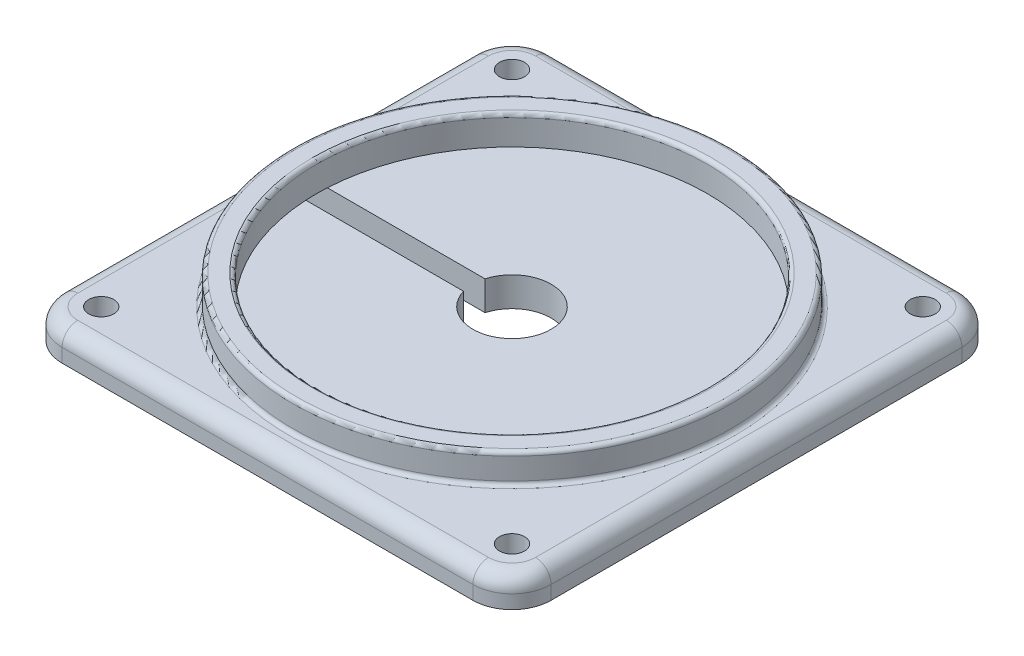
ISO-10303-21;
HEADER;
FILE_DESCRIPTION(('STEP AP214'),'2;1');
FILE_NAME('part.step','',(''),(''),'','','');
FILE_SCHEMA(('AUTOMOTIVE_DESIGN { 1 0 10303 214 1 1 1 1 }'));
ENDSEC;
DATA;
#1=APPLICATION_CONTEXT('core data for automotive mechanical design processes');
#2=APPLICATION_PROTOCOL_DEFINITION('international standard','automotive_design',2000,#1);
#3=PRODUCT_CONTEXT('',#1,'mechanical');
#4=PRODUCT('Part','Part','',(#3));
#5=PRODUCT_RELATED_PRODUCT_CATEGORY('part','',(#4));
#6=PRODUCT_DEFINITION_FORMATION('','',#4);
#7=PRODUCT_DEFINITION_CONTEXT('part definition',#1,'design');
#8=PRODUCT_DEFINITION('design','',#6,#7);
#9=PRODUCT_DEFINITION_SHAPE('','',#8);
#10=(LENGTH_UNIT() NAMED_UNIT(*) SI_UNIT(.MILLI.,.METRE.));
#11=(NAMED_UNIT(*) PLANE_ANGLE_UNIT() SI_UNIT($,.RADIAN.));
#12=(NAMED_UNIT(*) SI_UNIT($,.STERADIAN.) SOLID_ANGLE_UNIT());
#13=UNCERTAINTY_MEASURE_WITH_UNIT(LENGTH_MEASURE(1.E-05),#10,'distance_accuracy_value','');
#14=(GEOMETRIC_REPRESENTATION_CONTEXT(3) GLOBAL_UNCERTAINTY_ASSIGNED_CONTEXT((#13)) GLOBAL_UNIT_ASSIGNED_CONTEXT((#10,
#11,#12)) REPRESENTATION_CONTEXT('',''));
#15=CARTESIAN_POINT('',(0.,0.,0.));
#16=DIRECTION('',(0.,0.,1.));
#17=DIRECTION('',(1.,0.,0.));
#18=AXIS2_PLACEMENT_3D('',#15,#16,#17);
#19=CARTESIAN_POINT('',(0.,7.5,0.));
#20=DIRECTION('',(0.,-1.,0.));
#21=DIRECTION('',(0.,0.,-1.));
#22=AXIS2_PLACEMENT_3D('',#19,#20,#21);
#23=PLANE('',#22);
#24=CARTESIAN_POINT('',(-52.5,7.5,52.5));
#25=DIRECTION('',(0.,-1.,0.));
#26=DIRECTION('',(0.,0.,-1.));
#27=AXIS2_PLACEMENT_3D('',#24,#25,#26);
#28=CIRCLE('',#27,3.2);
#29=CARTESIAN_POINT('',(-52.5,7.5,49.3));
#30=VERTEX_POINT('',#29);
#31=EDGE_CURVE('E546',#30,#30,#28,.F.);
#32=ORIENTED_EDGE('',*,*,#31,.F.);
#33=EDGE_LOOP('',(#32));
#34=FACE_BOUND('',#33,.T.);
#35=CARTESIAN_POINT('',(52.5,7.5,-52.5));
#36=DIRECTION('',(0.,-1.,0.));
#37=DIRECTION('',(0.,0.,-1.));
#38=AXIS2_PLACEMENT_3D('',#35,#36,#37);
#39=CIRCLE('',#38,3.20000000000001);
#40=CARTESIAN_POINT('',(52.5,7.5,-55.7));
#41=VERTEX_POINT('',#40);
#42=EDGE_CURVE('E236',#41,#41,#39,.F.);
#43=ORIENTED_EDGE('',*,*,#42,.F.);
#44=EDGE_LOOP('',(#43));
#45=FACE_BOUND('',#44,.T.);
#46=CARTESIAN_POINT('',(52.5,7.5,52.5));
#47=DIRECTION('',(0.,-1.,0.));
#48=DIRECTION('',(0.,0.,-1.));
#49=AXIS2_PLACEMENT_3D('',#46,#47,#48);
#50=CIRCLE('',#49,3.20000000000001);
#51=CARTESIAN_POINT('',(52.5,7.5,49.3));
#52=VERTEX_POINT('',#51);
#53=EDGE_CURVE('E239',#52,#52,#50,.F.);
#54=ORIENTED_EDGE('',*,*,#53,.F.);
#55=EDGE_LOOP('',(#54));
#56=FACE_BOUND('',#55,.T.);
#57=CARTESIAN_POINT('',(-52.5,7.5,-52.5));
#58=DIRECTION('',(0.,-1.,0.));
#59=DIRECTION('',(0.,0.,-1.));
#60=AXIS2_PLACEMENT_3D('',#57,#58,#59);
#61=CIRCLE('',#60,3.2);
#62=CARTESIAN_POINT('',(-52.5,7.5,-55.7));
#63=VERTEX_POINT('',#62);
#64=EDGE_CURVE('E549',#63,#63,#61,.F.);
#65=ORIENTED_EDGE('',*,*,#64,.F.);
#66=EDGE_LOOP('',(#65));
#67=FACE_BOUND('',#66,.T.);
#68=DIRECTION('',(-1.,0.,0.));
#69=VECTOR('',#68,1.);
#70=CARTESIAN_POINT('',(62.501,7.5,-2.72545669135088));
#71=LINE('',#70,#69);
#72=CARTESIAN_POINT('',(-56.9348038182584,7.5,-2.72545669135088));
#73=VERTEX_POINT('',#72);
#74=CARTESIAN_POINT('',(-58.5,7.5,-2.72545669135088));
#75=VERTEX_POINT('',#74);
#76=EDGE_CURVE('E505',#73,#75,#71,.T.);
#77=ORIENTED_EDGE('',*,*,#76,.F.);
#78=CARTESIAN_POINT('',(0.,7.5,0.));
#79=DIRECTION('',(0.,-1.,0.));
#80=DIRECTION('',(0.,0.,-1.));
#81=AXIS2_PLACEMENT_3D('',#78,#79,#80);
#82=CIRCLE('',#81,57.);
#83=CARTESIAN_POINT('',(-56.9324328430503,7.5,2.77454330864912));
#84=VERTEX_POINT('',#83);
#85=EDGE_CURVE('E63',#73,#84,#82,.T.);
#86=ORIENTED_EDGE('',*,*,#85,.T.);
#87=DIRECTION('',(-1.,0.,0.));
#88=VECTOR('',#87,1.);
#89=CARTESIAN_POINT('',(62.501,7.5,2.77454330864912));
#90=LINE('',#89,#88);
#91=CARTESIAN_POINT('',(-58.5,7.5,2.77454330864912));
#92=VERTEX_POINT('',#91);
#93=EDGE_CURVE('E330',#84,#92,#90,.T.);
#94=ORIENTED_EDGE('',*,*,#93,.T.);
#95=DIRECTION('',(0.,0.,1.));
#96=VECTOR('',#95,1.);
#97=CARTESIAN_POINT('',(-58.5,7.5,0.));
#98=LINE('',#97,#96);
#99=CARTESIAN_POINT('',(-58.5,7.5,52.5));
#100=VERTEX_POINT('',#99);
#101=EDGE_CURVE('E252',#92,#100,#98,.T.);
#102=ORIENTED_EDGE('',*,*,#101,.T.);
#103=CARTESIAN_POINT('',(-52.5,7.5,52.5));
#104=DIRECTION('',(0.,-1.,0.));
#105=DIRECTION('',(0.,0.,-1.));
#106=AXIS2_PLACEMENT_3D('',#103,#104,#105);
#107=CIRCLE('',#106,6.);
#108=CARTESIAN_POINT('',(-52.5,7.5,58.5));
#109=VERTEX_POINT('',#108);
#110=EDGE_CURVE('E277',#109,#100,#107,.T.);
#111=ORIENTED_EDGE('',*,*,#110,.F.);
#112=DIRECTION('',(1.,0.,0.));
#113=VECTOR('',#112,1.);
#114=CARTESIAN_POINT('',(0.,7.5,58.5));
#115=LINE('',#114,#113);
#116=CARTESIAN_POINT('',(52.5,7.5,58.5));
#117=VERTEX_POINT('',#116);
#118=EDGE_CURVE('E249',#109,#117,#115,.T.);
#119=ORIENTED_EDGE('',*,*,#118,.T.);
#120=CARTESIAN_POINT('',(52.5,7.5,52.5));
#121=DIRECTION('',(0.,-1.,0.));
#122=DIRECTION('',(0.,0.,-1.));
#123=AXIS2_PLACEMENT_3D('',#120,#121,#122);
#124=CIRCLE('',#123,6.);
#125=CARTESIAN_POINT('',(58.5,7.5,52.5));
#126=VERTEX_POINT('',#125);
#127=EDGE_CURVE('E283',#126,#117,#124,.T.);
#128=ORIENTED_EDGE('',*,*,#127,.F.);
#129=DIRECTION('',(0.,0.,-1.));
#130=VECTOR('',#129,1.);
#131=CARTESIAN_POINT('',(58.5,7.5,0.));
#132=LINE('',#131,#130);
#133=CARTESIAN_POINT('',(58.5,7.5,-52.5));
#134=VERTEX_POINT('',#133);
#135=EDGE_CURVE('E246',#126,#134,#132,.T.);
#136=ORIENTED_EDGE('',*,*,#135,.T.);
#137=CARTESIAN_POINT('',(52.5,7.5,-52.5));
#138=DIRECTION('',(0.,-1.,0.));
#139=DIRECTION('',(0.,0.,-1.));
#140=AXIS2_PLACEMENT_3D('',#137,#138,#139);
#141=CIRCLE('',#140,6.);
#142=CARTESIAN_POINT('',(52.5,7.5,-58.5));
#143=VERTEX_POINT('',#142);
#144=EDGE_CURVE('E280',#143,#134,#141,.T.);
#145=ORIENTED_EDGE('',*,*,#144,.F.);
#146=DIRECTION('',(-1.,0.,0.));
#147=VECTOR('',#146,1.);
#148=CARTESIAN_POINT('',(0.,7.5,-58.5));
#149=LINE('',#148,#147);
#150=CARTESIAN_POINT('',(-52.5,7.5,-58.5));
#151=VERTEX_POINT('',#150);
#152=EDGE_CURVE('E243',#143,#151,#149,.T.);
#153=ORIENTED_EDGE('',*,*,#152,.T.);
#154=CARTESIAN_POINT('',(-52.5,7.5,-52.5));
#155=DIRECTION('',(0.,-1.,0.));
#156=DIRECTION('',(0.,0.,-1.));
#157=AXIS2_PLACEMENT_3D('',#154,#155,#156);
#158=CIRCLE('',#157,6.);
#159=CARTESIAN_POINT('',(-58.5,7.5,-52.5));
#160=VERTEX_POINT('',#159);
#161=EDGE_CURVE('E274',#160,#151,#158,.T.);
#162=ORIENTED_EDGE('',*,*,#161,.F.);
#163=DIRECTION('',(0.,0.,1.));
#164=VECTOR('',#163,1.);
#165=CARTESIAN_POINT('',(-58.5,7.5,0.));
#166=LINE('',#165,#164);
#167=EDGE_CURVE('E235',#160,#75,#166,.T.);
#168=ORIENTED_EDGE('',*,*,#167,.T.);
#169=EDGE_LOOP('',(#77,#86,#94,#102,#111,#119,#128,#136,#145,#153,#162,#168));
#170=FACE_BOUND('',#169,.T.);
#171=ADVANCED_FACE('F35',(#34,#45,#56,#67,#170),#23,.F.);
#172=CARTESIAN_POINT('',(-62.5,15.,62.5));
#173=DIRECTION('',(1.,0.,0.));
#174=DIRECTION('',(0.,0.,-1.));
#175=AXIS2_PLACEMENT_3D('',#172,#173,#174);
#176=PLANE('',#175);
#177=DIRECTION('',(0.,0.,1.));
#178=VECTOR('',#177,1.);
#179=CARTESIAN_POINT('',(-62.5,0.,62.5));
#180=LINE('',#179,#178);
#181=CARTESIAN_POINT('',(-62.5,0.,2.77454330864912));
#182=VERTEX_POINT('',#181);
#183=CARTESIAN_POINT('',(-62.5,0.,52.5));
#184=VERTEX_POINT('',#183);
#185=EDGE_CURVE('E207',#182,#184,#180,.T.);
#186=ORIENTED_EDGE('',*,*,#185,.T.);
#187=DIRECTION('',(0.,-1.,0.));
#188=VECTOR('',#187,1.);
#189=CARTESIAN_POINT('',(-62.5,15.,52.5));
#190=LINE('',#189,#188);
#191=CARTESIAN_POINT('',(-62.5,3.5,52.5));
#192=VERTEX_POINT('',#191);
#193=EDGE_CURVE('E320',#184,#192,#190,.F.);
#194=ORIENTED_EDGE('',*,*,#193,.T.);
#195=DIRECTION('',(0.,0.,1.));
#196=VECTOR('',#195,1.);
#197=CARTESIAN_POINT('',(-62.5,3.5,62.5));
#198=LINE('',#197,#196);
#199=CARTESIAN_POINT('',(-62.5,3.5,2.77454330864912));
#200=VERTEX_POINT('',#199);
#201=EDGE_CURVE('E255',#192,#200,#198,.F.);
#202=ORIENTED_EDGE('',*,*,#201,.T.);
#203=DIRECTION('',(0.,1.,0.));
#204=VECTOR('',#203,1.);
#205=CARTESIAN_POINT('',(-62.5,0.,2.77454330864912));
#206=LINE('',#205,#204);
#207=EDGE_CURVE('E208',#182,#200,#206,.T.);
#208=ORIENTED_EDGE('',*,*,#207,.F.);
#209=EDGE_LOOP('',(#186,#194,#202,#208));
#210=FACE_BOUND('',#209,.T.);
#211=ADVANCED_FACE('F379',(#210),#176,.F.);
#212=CARTESIAN_POINT('',(0.,15.,0.));
#213=DIRECTION('',(0.,-1.,0.));
#214=DIRECTION('',(0.,0.,-1.));
#215=AXIS2_PLACEMENT_3D('',#212,#213,#214);
#216=PLANE('',#215);
#217=CARTESIAN_POINT('',(0.,15.,0.));
#218=DIRECTION('',(0.,-1.,0.));
#219=DIRECTION('',(0.,0.,-1.));
#220=AXIS2_PLACEMENT_3D('',#217,#218,#219);
#221=CIRCLE('',#220,55.);
#222=CARTESIAN_POINT('',(0.,15.,-55.));
#223=VERTEX_POINT('',#222);
#224=EDGE_CURVE('E342',#223,#223,#221,.F.);
#225=ORIENTED_EDGE('',*,*,#224,.T.);
#226=EDGE_LOOP('',(#225));
#227=FACE_BOUND('',#226,.T.);
#228=CARTESIAN_POINT('',(0.,15.,0.));
#229=DIRECTION('',(0.,-1.,0.));
#230=DIRECTION('',(0.,0.,-1.));
#231=AXIS2_PLACEMENT_3D('',#228,#229,#230);
#232=CIRCLE('',#231,51.);
#233=CARTESIAN_POINT('',(0.,15.,-51.));
#234=VERTEX_POINT('',#233);
#235=EDGE_CURVE('E326',#234,#234,#232,.T.);
#236=ORIENTED_EDGE('',*,*,#235,.T.);
#237=EDGE_LOOP('',(#236));
#238=FACE_BOUND('',#237,.T.);
#239=ADVANCED_FACE('F406',(#227,#238),#216,.F.);
#240=CARTESIAN_POINT('',(62.5,15.,62.5));
#241=DIRECTION('',(-1.,0.,0.));
#242=DIRECTION('',(0.,0.,1.));
#243=AXIS2_PLACEMENT_3D('',#240,#241,#242);
#244=PLANE('',#243);
#245=DIRECTION('',(0.,0.,-1.));
#246=VECTOR('',#245,1.);
#247=CARTESIAN_POINT('',(62.5,0.,62.5));
#248=LINE('',#247,#246);
#249=CARTESIAN_POINT('',(62.5,0.,52.5));
#250=VERTEX_POINT('',#249);
#251=CARTESIAN_POINT('',(62.5,0.,-52.5));
#252=VERTEX_POINT('',#251);
#253=EDGE_CURVE('E224',#250,#252,#248,.T.);
#254=ORIENTED_EDGE('',*,*,#253,.T.);
#255=DIRECTION('',(0.,-1.,0.));
#256=VECTOR('',#255,1.);
#257=CARTESIAN_POINT('',(62.5,15.,-52.5));
#258=LINE('',#257,#256);
#259=CARTESIAN_POINT('',(62.5,3.5,-52.5));
#260=VERTEX_POINT('',#259);
#261=EDGE_CURVE('E324',#252,#260,#258,.F.);
#262=ORIENTED_EDGE('',*,*,#261,.T.);
#263=DIRECTION('',(0.,0.,-1.));
#264=VECTOR('',#263,1.);
#265=CARTESIAN_POINT('',(62.5,3.5,62.5));
#266=LINE('',#265,#264);
#267=CARTESIAN_POINT('',(62.5,3.5,52.5));
#268=VERTEX_POINT('',#267);
#269=EDGE_CURVE('E263',#260,#268,#266,.F.);
#270=ORIENTED_EDGE('',*,*,#269,.T.);
#271=DIRECTION('',(0.,-1.,0.));
#272=VECTOR('',#271,1.);
#273=CARTESIAN_POINT('',(62.5,15.,52.5));
#274=LINE('',#273,#272);
#275=EDGE_CURVE('E322',#268,#250,#274,.T.);
#276=ORIENTED_EDGE('',*,*,#275,.T.);
#277=EDGE_LOOP('',(#254,#262,#270,#276));
#278=FACE_BOUND('',#277,.T.);
#279=ADVANCED_FACE('F409',(#278),#244,.F.);
#280=CARTESIAN_POINT('',(-62.5,15.,-62.5));
#281=DIRECTION('',(0.,0.,1.));
#282=DIRECTION('',(1.,0.,0.));
#283=AXIS2_PLACEMENT_3D('',#280,#281,#282);
#284=PLANE('',#283);
#285=DIRECTION('',(-1.,0.,0.));
#286=VECTOR('',#285,1.);
#287=CARTESIAN_POINT('',(-62.5,0.,-62.5));
#288=LINE('',#287,#286);
#289=CARTESIAN_POINT('',(52.5,0.,-62.5));
#290=VERTEX_POINT('',#289);
#291=CARTESIAN_POINT('',(-52.5,0.,-62.5));
#292=VERTEX_POINT('',#291);
#293=EDGE_CURVE('E227',#290,#292,#288,.T.);
#294=ORIENTED_EDGE('',*,*,#293,.T.);
#295=DIRECTION('',(0.,-1.,0.));
#296=VECTOR('',#295,1.);
#297=CARTESIAN_POINT('',(-52.5,15.,-62.5));
#298=LINE('',#297,#296);
#299=CARTESIAN_POINT('',(-52.5,3.5,-62.5));
#300=VERTEX_POINT('',#299);
#301=EDGE_CURVE('E314',#292,#300,#298,.F.);
#302=ORIENTED_EDGE('',*,*,#301,.T.);
#303=DIRECTION('',(-1.,0.,0.));
#304=VECTOR('',#303,1.);
#305=CARTESIAN_POINT('',(-62.5,3.5,-62.5));
#306=LINE('',#305,#304);
#307=CARTESIAN_POINT('',(52.5,3.5,-62.5));
#308=VERTEX_POINT('',#307);
#309=EDGE_CURVE('E266',#300,#308,#306,.F.);
#310=ORIENTED_EDGE('',*,*,#309,.T.);
#311=DIRECTION('',(0.,-1.,0.));
#312=VECTOR('',#311,1.);
#313=CARTESIAN_POINT('',(52.5,15.,-62.5));
#314=LINE('',#313,#312);
#315=EDGE_CURVE('E312',#308,#290,#314,.T.);
#316=ORIENTED_EDGE('',*,*,#315,.T.);
#317=EDGE_LOOP('',(#294,#302,#310,#316));
#318=FACE_BOUND('',#317,.T.);
#319=ADVANCED_FACE('F420',(#318),#284,.F.);
#320=DIRECTION('',(0.,0.,1.));
#321=VECTOR('',#320,1.);
#322=CARTESIAN_POINT('',(-62.5,3.5,62.5));
#323=LINE('',#322,#321);
#324=CARTESIAN_POINT('',(-62.5,3.5,-2.72545669135088));
#325=VERTEX_POINT('',#324);
#326=CARTESIAN_POINT('',(-62.5,3.5,-52.5));
#327=VERTEX_POINT('',#326);
#328=EDGE_CURVE('E271',#325,#327,#323,.F.);
#329=ORIENTED_EDGE('',*,*,#328,.T.);
#330=DIRECTION('',(0.,-1.,0.));
#331=VECTOR('',#330,1.);
#332=CARTESIAN_POINT('',(-62.5,15.,-52.5));
#333=LINE('',#332,#331);
#334=CARTESIAN_POINT('',(-62.5,0.,-52.5));
#335=VERTEX_POINT('',#334);
#336=EDGE_CURVE('E302',#327,#335,#333,.T.);
#337=ORIENTED_EDGE('',*,*,#336,.T.);
#338=CARTESIAN_POINT('',(-62.5,0.,-2.72545669135088));
#339=VERTEX_POINT('',#338);
#340=EDGE_CURVE('E230',#335,#339,#180,.T.);
#341=ORIENTED_EDGE('',*,*,#340,.T.);
#342=DIRECTION('',(0.,-1.,0.));
#343=VECTOR('',#342,1.);
#344=CARTESIAN_POINT('',(-62.5,0.,-2.72545669135088));
#345=LINE('',#344,#343);
#346=EDGE_CURVE('E196',#325,#339,#345,.T.);
#347=ORIENTED_EDGE('',*,*,#346,.F.);
#348=EDGE_LOOP('',(#329,#337,#341,#347));
#349=FACE_BOUND('',#348,.T.);
#350=ADVANCED_FACE('F416',(#349),#176,.F.);
#351=CARTESIAN_POINT('',(-62.5,15.,62.5));
#352=DIRECTION('',(0.,0.,-1.));
#353=DIRECTION('',(-1.,0.,0.));
#354=AXIS2_PLACEMENT_3D('',#351,#352,#353);
#355=PLANE('',#354);
#356=DIRECTION('',(1.,0.,0.));
#357=VECTOR('',#356,1.);
#358=CARTESIAN_POINT('',(-62.5,3.5,62.5));
#359=LINE('',#358,#357);
#360=CARTESIAN_POINT('',(52.5,3.5,62.5));
#361=VERTEX_POINT('',#360);
#362=CARTESIAN_POINT('',(-52.5,3.5,62.5));
#363=VERTEX_POINT('',#362);
#364=EDGE_CURVE('E260',#361,#363,#359,.F.);
#365=ORIENTED_EDGE('',*,*,#364,.T.);
#366=DIRECTION('',(0.,-1.,0.));
#367=VECTOR('',#366,1.);
#368=CARTESIAN_POINT('',(-52.5,15.,62.5));
#369=LINE('',#368,#367);
#370=CARTESIAN_POINT('',(-52.5,0.,62.5));
#371=VERTEX_POINT('',#370);
#372=EDGE_CURVE('E318',#363,#371,#369,.T.);
#373=ORIENTED_EDGE('',*,*,#372,.T.);
#374=DIRECTION('',(1.,0.,0.));
#375=VECTOR('',#374,1.);
#376=CARTESIAN_POINT('',(-62.5,0.,62.5));
#377=LINE('',#376,#375);
#378=CARTESIAN_POINT('',(52.5,0.,62.5));
#379=VERTEX_POINT('',#378);
#380=EDGE_CURVE('E232',#371,#379,#377,.T.);
#381=ORIENTED_EDGE('',*,*,#380,.T.);
#382=DIRECTION('',(0.,-1.,0.));
#383=VECTOR('',#382,1.);
#384=CARTESIAN_POINT('',(52.5,15.,62.5));
#385=LINE('',#384,#383);
#386=EDGE_CURVE('E316',#379,#361,#385,.F.);
#387=ORIENTED_EDGE('',*,*,#386,.T.);
#388=EDGE_LOOP('',(#365,#373,#381,#387));
#389=FACE_BOUND('',#388,.T.);
#390=ADVANCED_FACE('F413',(#389),#355,.F.);
#391=CARTESIAN_POINT('',(0.,0.,0.));
#392=DIRECTION('',(0.,-1.,0.));
#393=DIRECTION('',(0.,0.,-1.));
#394=AXIS2_PLACEMENT_3D('',#391,#392,#393);
#395=PLANE('',#394);
#396=ORIENTED_EDGE('',*,*,#340,.F.);
#397=CARTESIAN_POINT('',(-52.5,0.,-52.5));
#398=DIRECTION('',(0.,-1.,0.));
#399=DIRECTION('',(0.,0.,-1.));
#400=AXIS2_PLACEMENT_3D('',#397,#398,#399);
#401=CIRCLE('',#400,10.);
#402=EDGE_CURVE('E310',#335,#292,#401,.T.);
#403=ORIENTED_EDGE('',*,*,#402,.T.);
#404=ORIENTED_EDGE('',*,*,#293,.F.);
#405=CARTESIAN_POINT('',(52.5,0.,-52.5));
#406=DIRECTION('',(0.,-1.,0.));
#407=DIRECTION('',(0.,0.,-1.));
#408=AXIS2_PLACEMENT_3D('',#405,#406,#407);
#409=CIRCLE('',#408,10.);
#410=EDGE_CURVE('E306',#290,#252,#409,.T.);
#411=ORIENTED_EDGE('',*,*,#410,.T.);
#412=ORIENTED_EDGE('',*,*,#253,.F.);
#413=CARTESIAN_POINT('',(52.5,0.,52.5));
#414=DIRECTION('',(0.,-1.,0.));
#415=DIRECTION('',(0.,0.,-1.));
#416=AXIS2_PLACEMENT_3D('',#413,#414,#415);
#417=CIRCLE('',#416,10.);
#418=EDGE_CURVE('E304',#250,#379,#417,.T.);
#419=ORIENTED_EDGE('',*,*,#418,.T.);
#420=ORIENTED_EDGE('',*,*,#380,.F.);
#421=CARTESIAN_POINT('',(-52.5,0.,52.5));
#422=DIRECTION('',(0.,-1.,0.));
#423=DIRECTION('',(0.,0.,-1.));
#424=AXIS2_PLACEMENT_3D('',#421,#422,#423);
#425=CIRCLE('',#424,10.);
#426=EDGE_CURVE('E308',#371,#184,#425,.T.);
#427=ORIENTED_EDGE('',*,*,#426,.T.);
#428=ORIENTED_EDGE('',*,*,#185,.F.);
#429=DIRECTION('',(-1.,0.,0.));
#430=VECTOR('',#429,1.);
#431=CARTESIAN_POINT('',(62.501,0.,2.77454330864912));
#432=LINE('',#431,#430);
#433=CARTESIAN_POINT('',(-9.60738827301314,0.,2.77454330864912));
#434=VERTEX_POINT('',#433);
#435=EDGE_CURVE('E187',#434,#182,#432,.T.);
#436=ORIENTED_EDGE('',*,*,#435,.F.);
#437=CARTESIAN_POINT('',(0.,0.,0.));
#438=DIRECTION('',(0.,1.,0.));
#439=DIRECTION('',(0.,0.,1.));
#440=AXIS2_PLACEMENT_3D('',#437,#438,#439);
#441=CIRCLE('',#440,10.);
#442=CARTESIAN_POINT('',(-9.62142847105203,0.,-2.72545669135088));
#443=VERTEX_POINT('',#442);
#444=EDGE_CURVE('E205',#434,#443,#441,.T.);
#445=ORIENTED_EDGE('',*,*,#444,.T.);
#446=DIRECTION('',(-1.,0.,0.));
#447=VECTOR('',#446,1.);
#448=CARTESIAN_POINT('',(62.501,0.,-2.72545669135088));
#449=LINE('',#448,#447);
#450=EDGE_CURVE('E504',#443,#339,#449,.T.);
#451=ORIENTED_EDGE('',*,*,#450,.T.);
#452=EDGE_LOOP('',(#396,#403,#404,#411,#412,#419,#420,#427,#428,#436,#445,#451));
#453=FACE_BOUND('',#452,.T.);
#454=CARTESIAN_POINT('',(52.5,0.,-52.5));
#455=DIRECTION('',(0.,1.,0.));
#456=DIRECTION('',(0.,0.,-1.));
#457=AXIS2_PLACEMENT_3D('',#454,#455,#456);
#458=CIRCLE('',#457,3.20000000000001);
#459=CARTESIAN_POINT('',(52.5,0.,-55.7));
#460=VERTEX_POINT('',#459);
#461=EDGE_CURVE('E552',#460,#460,#458,.T.);
#462=ORIENTED_EDGE('',*,*,#461,.T.);
#463=EDGE_LOOP('',(#462));
#464=FACE_BOUND('',#463,.T.);
#465=CARTESIAN_POINT('',(52.5,0.,52.5));
#466=DIRECTION('',(0.,1.,0.));
#467=DIRECTION('',(0.,0.,1.));
#468=AXIS2_PLACEMENT_3D('',#465,#466,#467);
#469=CIRCLE('',#468,3.20000000000001);
#470=CARTESIAN_POINT('',(52.5,0.,55.7));
#471=VERTEX_POINT('',#470);
#472=EDGE_CURVE('E556',#471,#471,#469,.T.);
#473=ORIENTED_EDGE('',*,*,#472,.T.);
#474=EDGE_LOOP('',(#473));
#475=FACE_BOUND('',#474,.T.);
#476=CARTESIAN_POINT('',(-52.5,0.,52.5));
#477=DIRECTION('',(0.,1.,0.));
#478=DIRECTION('',(0.,0.,-1.));
#479=AXIS2_PLACEMENT_3D('',#476,#477,#478);
#480=CIRCLE('',#479,3.2);
#481=CARTESIAN_POINT('',(-52.5,0.,49.3));
#482=VERTEX_POINT('',#481);
#483=EDGE_CURVE('E553',#482,#482,#480,.T.);
#484=ORIENTED_EDGE('',*,*,#483,.T.);
#485=EDGE_LOOP('',(#484));
#486=FACE_BOUND('',#485,.T.);
#487=CARTESIAN_POINT('',(-52.5,0.,-52.5));
#488=DIRECTION('',(0.,1.,0.));
#489=DIRECTION('',(0.,0.,1.));
#490=AXIS2_PLACEMENT_3D('',#487,#488,#489);
#491=CIRCLE('',#490,3.2);
#492=CARTESIAN_POINT('',(-52.5,0.,-49.3));
#493=VERTEX_POINT('',#492);
#494=EDGE_CURVE('E219',#493,#493,#491,.T.);
#495=ORIENTED_EDGE('',*,*,#494,.T.);
#496=EDGE_LOOP('',(#495));
#497=FACE_BOUND('',#496,.T.);
#498=ADVANCED_FACE('F202',(#453,#464,#475,#486,#497),#395,.T.);
#499=CARTESIAN_POINT('',(0.,7.5,0.));
#500=DIRECTION('',(0.,1.,0.));
#501=DIRECTION('',(0.,0.,1.));
#502=AXIS2_PLACEMENT_3D('',#499,#500,#501);
#503=CYLINDRICAL_SURFACE('',#502,50.);
#504=CARTESIAN_POINT('',(0.,14.,0.));
#505=DIRECTION('',(0.,-1.,0.));
#506=DIRECTION('',(0.,0.,-1.));
#507=AXIS2_PLACEMENT_3D('',#504,#505,#506);
#508=CIRCLE('',#507,50.);
#509=CARTESIAN_POINT('',(0.,14.,-50.));
#510=VERTEX_POINT('',#509);
#511=EDGE_CURVE('E348',#510,#510,#508,.F.);
#512=ORIENTED_EDGE('',*,*,#511,.T.);
#513=EDGE_LOOP('',(#512));
#514=FACE_BOUND('',#513,.T.);
#515=CARTESIAN_POINT('',(0.,7.5,0.));
#516=DIRECTION('',(0.,1.,0.));
#517=DIRECTION('',(0.,0.,1.));
#518=AXIS2_PLACEMENT_3D('',#515,#516,#517);
#519=CIRCLE('',#518,50.);
#520=CARTESIAN_POINT('',(-49.9256635992309,7.5,-2.72545669135088));
#521=VERTEX_POINT('',#520);
#522=CARTESIAN_POINT('',(-49.9229597422712,7.5,2.77454330864912));
#523=VERTEX_POINT('',#522);
#524=EDGE_CURVE('E217',#521,#523,#519,.T.);
#525=ORIENTED_EDGE('',*,*,#524,.F.);
#526=EDGE_CURVE('E213',#523,#521,#519,.T.);
#527=ORIENTED_EDGE('',*,*,#526,.F.);
#528=EDGE_LOOP('',(#525,#527));
#529=FACE_BOUND('',#528,.T.);
#530=ADVANCED_FACE('F401',(#514,#529),#503,.F.);
#531=CARTESIAN_POINT('',(0.,7.5,0.));
#532=DIRECTION('',(0.,1.,0.));
#533=DIRECTION('',(0.,0.,1.));
#534=AXIS2_PLACEMENT_3D('',#531,#532,#533);
#535=PLANE('',#534);
#536=CARTESIAN_POINT('',(-9.60738827301314,7.5,2.77454330864912));
#537=VERTEX_POINT('',#536);
#538=EDGE_CURVE('E190',#537,#523,#90,.T.);
#539=ORIENTED_EDGE('',*,*,#538,.T.);
#540=ORIENTED_EDGE('',*,*,#526,.T.);
#541=CARTESIAN_POINT('',(-9.62142847105204,7.5,-2.72545669135088));
#542=VERTEX_POINT('',#541);
#543=EDGE_CURVE('E209',#542,#521,#71,.T.);
#544=ORIENTED_EDGE('',*,*,#543,.F.);
#545=CARTESIAN_POINT('',(0.,7.5,0.));
#546=DIRECTION('',(0.,1.,0.));
#547=DIRECTION('',(0.,0.,1.));
#548=AXIS2_PLACEMENT_3D('',#545,#546,#547);
#549=CIRCLE('',#548,10.);
#550=EDGE_CURVE('E214',#537,#542,#549,.T.);
#551=ORIENTED_EDGE('',*,*,#550,.F.);
#552=EDGE_LOOP('',(#539,#540,#544,#551));
#553=FACE_BOUND('',#552,.T.);
#554=ADVANCED_FACE('F398',(#553),#535,.T.);
#555=CARTESIAN_POINT('',(0.,0.,0.));
#556=DIRECTION('',(0.,1.,0.));
#557=DIRECTION('',(0.,0.,1.));
#558=AXIS2_PLACEMENT_3D('',#555,#556,#557);
#559=CYLINDRICAL_SURFACE('',#558,10.);
#560=ORIENTED_EDGE('',*,*,#444,.F.);
#561=DIRECTION('',(0.,1.,0.));
#562=VECTOR('',#561,1.);
#563=CARTESIAN_POINT('',(-9.60738827301314,0.,2.77454330864912));
#564=LINE('',#563,#562);
#565=EDGE_CURVE('E183',#537,#434,#564,.F.);
#566=ORIENTED_EDGE('',*,*,#565,.F.);
#567=ORIENTED_EDGE('',*,*,#550,.T.);
#568=DIRECTION('',(0.,1.,0.));
#569=VECTOR('',#568,1.);
#570=CARTESIAN_POINT('',(-9.62142847105204,0.,-2.72545669135088));
#571=LINE('',#570,#569);
#572=EDGE_CURVE('E195',#443,#542,#571,.T.);
#573=ORIENTED_EDGE('',*,*,#572,.F.);
#574=EDGE_LOOP('',(#560,#566,#567,#573));
#575=FACE_BOUND('',#574,.T.);
#576=ADVANCED_FACE('F212',(#575),#559,.F.);
#577=CARTESIAN_POINT('',(-52.5,0.,-52.5));
#578=DIRECTION('',(0.,1.,0.));
#579=DIRECTION('',(0.,0.,1.));
#580=AXIS2_PLACEMENT_3D('',#577,#578,#579);
#581=CYLINDRICAL_SURFACE('',#580,3.2);
#582=ORIENTED_EDGE('',*,*,#64,.T.);
#583=EDGE_LOOP('',(#582));
#584=FACE_BOUND('',#583,.T.);
#585=ORIENTED_EDGE('',*,*,#494,.F.);
#586=EDGE_LOOP('',(#585));
#587=FACE_BOUND('',#586,.T.);
#588=ADVANCED_FACE('F385',(#584,#587),#581,.F.);
#589=CARTESIAN_POINT('',(-52.5,0.,52.5));
#590=DIRECTION('',(0.,1.,0.));
#591=DIRECTION('',(0.,0.,1.));
#592=AXIS2_PLACEMENT_3D('',#589,#590,#591);
#593=CYLINDRICAL_SURFACE('',#592,3.2);
#594=ORIENTED_EDGE('',*,*,#31,.T.);
#595=EDGE_LOOP('',(#594));
#596=FACE_BOUND('',#595,.T.);
#597=ORIENTED_EDGE('',*,*,#483,.F.);
#598=EDGE_LOOP('',(#597));
#599=FACE_BOUND('',#598,.T.);
#600=ADVANCED_FACE('F381',(#596,#599),#593,.F.);
#601=CARTESIAN_POINT('',(52.5,0.,52.5));
#602=DIRECTION('',(0.,1.,0.));
#603=DIRECTION('',(0.,0.,1.));
#604=AXIS2_PLACEMENT_3D('',#601,#602,#603);
#605=CYLINDRICAL_SURFACE('',#604,3.20000000000001);
#606=ORIENTED_EDGE('',*,*,#53,.T.);
#607=EDGE_LOOP('',(#606));
#608=FACE_BOUND('',#607,.T.);
#609=ORIENTED_EDGE('',*,*,#472,.F.);
#610=EDGE_LOOP('',(#609));
#611=FACE_BOUND('',#610,.T.);
#612=ADVANCED_FACE('F384',(#608,#611),#605,.F.);
#613=CARTESIAN_POINT('',(52.5,0.,-52.5));
#614=DIRECTION('',(0.,1.,0.));
#615=DIRECTION('',(0.,0.,1.));
#616=AXIS2_PLACEMENT_3D('',#613,#614,#615);
#617=CYLINDRICAL_SURFACE('',#616,3.20000000000001);
#618=ORIENTED_EDGE('',*,*,#42,.T.);
#619=EDGE_LOOP('',(#618));
#620=FACE_BOUND('',#619,.T.);
#621=ORIENTED_EDGE('',*,*,#461,.F.);
#622=EDGE_LOOP('',(#621));
#623=FACE_BOUND('',#622,.T.);
#624=ADVANCED_FACE('F375',(#620,#623),#617,.F.);
#625=CARTESIAN_POINT('',(0.,7.5,0.));
#626=DIRECTION('',(0.,1.,0.));
#627=DIRECTION('',(0.,0.,1.));
#628=AXIS2_PLACEMENT_3D('',#625,#626,#627);
#629=CYLINDRICAL_SURFACE('',#628,56.);
#630=CARTESIAN_POINT('',(0.,14.,0.));
#631=DIRECTION('',(0.,-1.,0.));
#632=DIRECTION('',(0.,0.,-1.));
#633=AXIS2_PLACEMENT_3D('',#630,#631,#632);
#634=CIRCLE('',#633,56.);
#635=CARTESIAN_POINT('',(0.,14.,-56.));
#636=VERTEX_POINT('',#635);
#637=EDGE_CURVE('E345',#636,#636,#634,.T.);
#638=ORIENTED_EDGE('',*,*,#637,.T.);
#639=EDGE_LOOP('',(#638));
#640=FACE_BOUND('',#639,.T.);
#641=CARTESIAN_POINT('',(0.,8.5,0.));
#642=DIRECTION('',(0.,-1.,0.));
#643=DIRECTION('',(0.,0.,-1.));
#644=AXIS2_PLACEMENT_3D('',#641,#642,#643);
#645=CIRCLE('',#644,56.);
#646=CARTESIAN_POINT('',(-55.9312248160938,8.5,2.77454330864912));
#647=VERTEX_POINT('',#646);
#648=CARTESIAN_POINT('',(-55.9336382316006,8.5,-2.72545669135088));
#649=VERTEX_POINT('',#648);
#650=EDGE_CURVE('E352',#647,#649,#645,.F.);
#651=ORIENTED_EDGE('',*,*,#650,.T.);
#652=DIRECTION('',(0.,1.,0.));
#653=VECTOR('',#652,1.);
#654=CARTESIAN_POINT('',(-55.9336382316006,8.5,-2.72545669135088));
#655=LINE('',#654,#653);
#656=CARTESIAN_POINT('',(-55.9336382316006,7.5,-2.72545669135088));
#657=VERTEX_POINT('',#656);
#658=EDGE_CURVE('E355',#649,#657,#655,.F.);
#659=ORIENTED_EDGE('',*,*,#658,.T.);
#660=CARTESIAN_POINT('',(0.,7.5,0.));
#661=DIRECTION('',(0.,1.,0.));
#662=DIRECTION('',(0.,0.,1.));
#663=AXIS2_PLACEMENT_3D('',#660,#661,#662);
#664=CIRCLE('',#663,56.);
#665=CARTESIAN_POINT('',(-55.9312248160938,7.5,2.77454330864912));
#666=VERTEX_POINT('',#665);
#667=EDGE_CURVE('E240',#657,#666,#664,.T.);
#668=ORIENTED_EDGE('',*,*,#667,.T.);
#669=DIRECTION('',(0.,1.,0.));
#670=VECTOR('',#669,1.);
#671=CARTESIAN_POINT('',(-55.9312248160938,7.5,2.77454330864912));
#672=LINE('',#671,#670);
#673=EDGE_CURVE('E55',#666,#647,#672,.T.);
#674=ORIENTED_EDGE('',*,*,#673,.T.);
#675=EDGE_LOOP('',(#651,#659,#668,#674));
#676=FACE_BOUND('',#675,.T.);
#677=ADVANCED_FACE('F372',(#640,#676),#629,.T.);
#678=CARTESIAN_POINT('',(62.501,7.5,-2.72545669135088));
#679=DIRECTION('',(0.,1.,0.));
#680=DIRECTION('',(0.,0.,1.));
#681=AXIS2_PLACEMENT_3D('',#678,#679,#680);
#682=PLANE('',#681);
#683=EDGE_CURVE('E498',#523,#666,#90,.T.);
#684=ORIENTED_EDGE('',*,*,#683,.T.);
#685=ORIENTED_EDGE('',*,*,#667,.F.);
#686=EDGE_CURVE('E500',#521,#657,#71,.T.);
#687=ORIENTED_EDGE('',*,*,#686,.F.);
#688=ORIENTED_EDGE('',*,*,#524,.T.);
#689=EDGE_LOOP('',(#684,#685,#687,#688));
#690=FACE_BOUND('',#689,.T.);
#691=ADVANCED_FACE('F368',(#690),#682,.F.);
#692=CARTESIAN_POINT('',(62.501,0.,2.77454330864912));
#693=DIRECTION('',(0.,0.,1.));
#694=DIRECTION('',(1.,0.,0.));
#695=AXIS2_PLACEMENT_3D('',#692,#693,#694);
#696=PLANE('',#695);
#697=ORIENTED_EDGE('',*,*,#207,.T.);
#698=CARTESIAN_POINT('',(-58.5,3.5,2.77454330864912));
#699=DIRECTION('',(0.,0.,1.));
#700=DIRECTION('',(1.,0.,0.));
#701=AXIS2_PLACEMENT_3D('',#698,#699,#700);
#702=CIRCLE('',#701,4.);
#703=EDGE_CURVE('E257',#200,#92,#702,.F.);
#704=ORIENTED_EDGE('',*,*,#703,.T.);
#705=ORIENTED_EDGE('',*,*,#93,.F.);
#706=CARTESIAN_POINT('',(-56.9324328430503,7.5,2.77454330864912));
#707=CARTESIAN_POINT('',(-56.9042396066923,7.5000002051768,2.77454330864912));
#708=CARTESIAN_POINT('',(-56.8760598706942,7.50119020747072,2.77454330864912));
#709=CARTESIAN_POINT('',(-56.8199018746253,7.50593770591,2.77454330864912));
#710=CARTESIAN_POINT('',(-56.791923605391,7.50949509368112,2.77454330864912));
#711=CARTESIAN_POINT('',(-56.7086386416079,7.52368504435214,2.77454330864912));
#712=CARTESIAN_POINT('',(-56.6538895428888,7.53783548544671,2.77454330864912));
#713=CARTESIAN_POINT('',(-56.5475451979961,7.57512759382099,2.77454330864912));
#714=CARTESIAN_POINT('',(-56.4959515142103,7.59827367419265,2.77454330864912));
#715=CARTESIAN_POINT('',(-56.3973868830573,7.65290092126897,2.77454330864912));
#716=CARTESIAN_POINT('',(-56.3504150809939,7.68438054291456,2.77454330864912));
#717=CARTESIAN_POINT('',(-56.2624546419764,7.75476671689417,2.77454330864912));
#718=CARTESIAN_POINT('',(-56.2214628936165,7.79366938254475,2.77454330864912));
#719=CARTESIAN_POINT('',(-56.1465926144502,7.87782082443127,2.77454330864912));
#720=CARTESIAN_POINT('',(-56.112715459684,7.92307082549368,2.77454330864912));
#721=CARTESIAN_POINT('',(-56.0530835029186,8.01857403592317,2.77454330864912));
#722=CARTESIAN_POINT('',(-56.0273210999162,8.06882250486411,2.77454330864912));
#723=CARTESIAN_POINT('',(-55.9846221652168,8.17292452561646,2.77454330864912));
#724=CARTESIAN_POINT('',(-55.9676803103879,8.22677588091602,2.77454330864912));
#725=CARTESIAN_POINT('',(-55.9473573993776,8.31746953326727,2.77454330864912));
#726=CARTESIAN_POINT('',(-55.941311334497,8.35373694510881,2.77454330864912));
#727=CARTESIAN_POINT('',(-55.9332456091711,8.42666445316401,2.77454330864912));
#728=CARTESIAN_POINT('',(-55.9312202382401,8.46332391799544,2.77454330864912));
#729=CARTESIAN_POINT('',(-55.9312248160938,8.5,2.77454330864912));
#730=B_SPLINE_CURVE_WITH_KNOTS('',3,(#706,#707,#708,#709,#710,#711,#712,#713,#714,#715,#716,
#717,#718,#719,#720,#721,#722,#723,#724,#725,#726,#727,#728,#729),.UNSPECIFIED.,.F.,.F.,(4,2,2,
2,2,2,2,2,2,2,2,4),(0.,0.0845277825775678,0.169051695906566,0.337826298835144,0.506683804146294,
0.675510024759453,0.844248089843299,1.01301876071817,1.18163087249082,1.35014110987414,
1.46023759423245,1.57017759926443),.UNSPECIFIED.);
#731=EDGE_CURVE('E11',#84,#647,#730,.T.);
#732=ORIENTED_EDGE('',*,*,#731,.T.);
#733=ORIENTED_EDGE('',*,*,#673,.F.);
#734=ORIENTED_EDGE('',*,*,#683,.F.);
#735=ORIENTED_EDGE('',*,*,#538,.F.);
#736=ORIENTED_EDGE('',*,*,#565,.T.);
#737=ORIENTED_EDGE('',*,*,#435,.T.);
#738=EDGE_LOOP('',(#697,#704,#705,#732,#733,#734,#735,#736,#737));
#739=FACE_BOUND('',#738,.T.);
#740=ADVANCED_FACE('F186',(#739),#696,.F.);
#741=CARTESIAN_POINT('',(62.501,0.,-2.72545669135088));
#742=DIRECTION('',(0.,0.,-1.));
#743=DIRECTION('',(-1.,0.,0.));
#744=AXIS2_PLACEMENT_3D('',#741,#742,#743);
#745=PLANE('',#744);
#746=ORIENTED_EDGE('',*,*,#686,.T.);
#747=ORIENTED_EDGE('',*,*,#658,.F.);
#748=CARTESIAN_POINT('',(-55.9336382316006,8.5,-2.72545669135088));
#749=CARTESIAN_POINT('',(-55.9336384006136,8.47188935469663,-2.72545669135088));
#750=CARTESIAN_POINT('',(-55.9348256965015,8.4437921851124,-2.72545669135088));
#751=CARTESIAN_POINT('',(-55.9395621808732,8.38779909385694,-2.72545669135088));
#752=CARTESIAN_POINT('',(-55.9431112503884,8.35990316212039,-2.72545669135088));
#753=CARTESIAN_POINT('',(-55.957266860855,8.27686764548891,-2.72545669135088));
#754=CARTESIAN_POINT('',(-55.9713819003987,8.22228457070609,-2.72545669135088));
#755=CARTESIAN_POINT('',(-56.0085737994256,8.11626489646092,-2.72545669135088));
#756=CARTESIAN_POINT('',(-56.031654855516,8.06482978349321,-2.72545669135088));
#757=CARTESIAN_POINT('',(-56.0861178498084,7.96656288407603,-2.72545669135088));
#758=CARTESIAN_POINT('',(-56.1174984059078,7.91973033294858,-2.72545669135088));
#759=CARTESIAN_POINT('',(-56.1876857393099,7.83196986806909,-2.72545669135088));
#760=CARTESIAN_POINT('',(-56.2264963743287,7.791045041069,-2.72545669135088));
#761=CARTESIAN_POINT('',(-56.3104397387811,7.71627447002452,-2.72545669135088));
#762=CARTESIAN_POINT('',(-56.3555737181202,7.68243012885205,-2.72545669135088));
#763=CARTESIAN_POINT('',(-56.4509330963612,7.62274691340885,-2.72545669135088));
#764=CARTESIAN_POINT('',(-56.5011650867742,7.59691858308769,-2.72545669135088));
#765=CARTESIAN_POINT('',(-56.605239622449,7.55406492995869,-2.72545669135088));
#766=CARTESIAN_POINT('',(-56.6590800910395,7.53703459224388,-2.72545669135088));
#767=CARTESIAN_POINT('',(-56.7501702958661,7.51645101902943,-2.72545669135088));
#768=CARTESIAN_POINT('',(-56.7868511701863,7.51028563664012,-2.72545669135088));
#769=CARTESIAN_POINT('',(-56.8606175554472,7.50206063598352,-2.72545669135088));
#770=CARTESIAN_POINT('',(-56.89770241835,7.49999520405601,-2.72545669135088));
#771=CARTESIAN_POINT('',(-56.9348038182584,7.5,-2.72545669135088));
#772=B_SPLINE_CURVE_WITH_KNOTS('',3,(#748,#749,#750,#751,#752,#753,#754,#755,#756,#757,#758,
#759,#760,#761,#762,#763,#764,#765,#766,#767,#768,#769,#770,#771),.UNSPECIFIED.,.F.,.F.,(4,2,2,
2,2,2,2,2,2,2,2,4),(0.,0.0842801076844151,0.168555970281436,0.336824048923862,0.50517098170517,
0.673489897569689,0.841896443229637,1.01033632410713,1.17899683433475,1.3475611007201,
1.45893370119014,1.57014826406795),.UNSPECIFIED.);
#773=EDGE_CURVE('E49',#649,#73,#772,.T.);
#774=ORIENTED_EDGE('',*,*,#773,.T.);
#775=ORIENTED_EDGE('',*,*,#76,.T.);
#776=CARTESIAN_POINT('',(-58.5,3.5,-2.72545669135088));
#777=DIRECTION('',(0.,0.,-1.));
#778=DIRECTION('',(-1.,0.,0.));
#779=AXIS2_PLACEMENT_3D('',#776,#777,#778);
#780=CIRCLE('',#779,4.);
#781=EDGE_CURVE('E269',#75,#325,#780,.F.);
#782=ORIENTED_EDGE('',*,*,#781,.T.);
#783=ORIENTED_EDGE('',*,*,#346,.T.);
#784=ORIENTED_EDGE('',*,*,#450,.F.);
#785=ORIENTED_EDGE('',*,*,#572,.T.);
#786=ORIENTED_EDGE('',*,*,#543,.T.);
#787=EDGE_LOOP('',(#746,#747,#774,#775,#782,#783,#784,#785,#786));
#788=FACE_BOUND('',#787,.T.);
#789=ADVANCED_FACE('F362',(#788),#745,.F.);
#790=CARTESIAN_POINT('',(-58.5,3.5,0.));
#791=DIRECTION('',(0.,0.,1.));
#792=DIRECTION('',(1.,0.,0.));
#793=AXIS2_PLACEMENT_3D('',#790,#791,#792);
#794=CYLINDRICAL_SURFACE('',#793,4.);
#795=ORIENTED_EDGE('',*,*,#167,.F.);
#796=CARTESIAN_POINT('',(-58.5,3.5,-52.5));
#797=DIRECTION('',(0.,0.,1.));
#798=DIRECTION('',(1.,0.,0.));
#799=AXIS2_PLACEMENT_3D('',#796,#797,#798);
#800=CIRCLE('',#799,4.);
#801=EDGE_CURVE('E300',#160,#327,#800,.T.);
#802=ORIENTED_EDGE('',*,*,#801,.T.);
#803=ORIENTED_EDGE('',*,*,#328,.F.);
#804=ORIENTED_EDGE('',*,*,#781,.F.);
#805=EDGE_LOOP('',(#795,#802,#803,#804));
#806=FACE_BOUND('',#805,.T.);
#807=ADVANCED_FACE('F366',(#806),#794,.T.);
#808=CARTESIAN_POINT('',(0.,3.5,-58.5));
#809=DIRECTION('',(-1.,0.,0.));
#810=DIRECTION('',(0.,0.,1.));
#811=AXIS2_PLACEMENT_3D('',#808,#809,#810);
#812=CYLINDRICAL_SURFACE('',#811,4.);
#813=ORIENTED_EDGE('',*,*,#309,.F.);
#814=CARTESIAN_POINT('',(-52.5,3.5,-58.5));
#815=DIRECTION('',(1.,0.,0.));
#816=DIRECTION('',(0.,0.,-1.));
#817=AXIS2_PLACEMENT_3D('',#814,#815,#816);
#818=CIRCLE('',#817,4.);
#819=EDGE_CURVE('E298',#300,#151,#818,.T.);
#820=ORIENTED_EDGE('',*,*,#819,.T.);
#821=ORIENTED_EDGE('',*,*,#152,.F.);
#822=CARTESIAN_POINT('',(52.5,3.5,-58.5));
#823=DIRECTION('',(-1.,0.,0.));
#824=DIRECTION('',(0.,0.,1.));
#825=AXIS2_PLACEMENT_3D('',#822,#823,#824);
#826=CIRCLE('',#825,4.);
#827=EDGE_CURVE('E296',#143,#308,#826,.T.);
#828=ORIENTED_EDGE('',*,*,#827,.T.);
#829=EDGE_LOOP('',(#813,#820,#821,#828));
#830=FACE_BOUND('',#829,.T.);
#831=ADVANCED_FACE('F440',(#830),#812,.T.);
#832=CARTESIAN_POINT('',(58.5,3.5,0.));
#833=DIRECTION('',(0.,0.,-1.));
#834=DIRECTION('',(-1.,0.,0.));
#835=AXIS2_PLACEMENT_3D('',#832,#833,#834);
#836=CYLINDRICAL_SURFACE('',#835,4.);
#837=ORIENTED_EDGE('',*,*,#269,.F.);
#838=CARTESIAN_POINT('',(58.5,3.5,-52.5));
#839=DIRECTION('',(0.,0.,1.));
#840=DIRECTION('',(1.,0.,0.));
#841=AXIS2_PLACEMENT_3D('',#838,#839,#840);
#842=CIRCLE('',#841,4.);
#843=EDGE_CURVE('E292',#260,#134,#842,.T.);
#844=ORIENTED_EDGE('',*,*,#843,.T.);
#845=ORIENTED_EDGE('',*,*,#135,.F.);
#846=CARTESIAN_POINT('',(58.5,3.5,52.5));
#847=DIRECTION('',(0.,0.,-1.));
#848=DIRECTION('',(-1.,0.,0.));
#849=AXIS2_PLACEMENT_3D('',#846,#847,#848);
#850=CIRCLE('',#849,4.);
#851=EDGE_CURVE('E290',#126,#268,#850,.T.);
#852=ORIENTED_EDGE('',*,*,#851,.T.);
#853=EDGE_LOOP('',(#837,#844,#845,#852));
#854=FACE_BOUND('',#853,.T.);
#855=ADVANCED_FACE('F436',(#854),#836,.T.);
#856=CARTESIAN_POINT('',(0.,3.5,58.5));
#857=DIRECTION('',(1.,0.,0.));
#858=DIRECTION('',(0.,0.,-1.));
#859=AXIS2_PLACEMENT_3D('',#856,#857,#858);
#860=CYLINDRICAL_SURFACE('',#859,4.);
#861=ORIENTED_EDGE('',*,*,#364,.F.);
#862=CARTESIAN_POINT('',(52.5,3.5,58.5));
#863=DIRECTION('',(-1.,0.,0.));
#864=DIRECTION('',(0.,0.,1.));
#865=AXIS2_PLACEMENT_3D('',#862,#863,#864);
#866=CIRCLE('',#865,4.);
#867=EDGE_CURVE('E288',#361,#117,#866,.T.);
#868=ORIENTED_EDGE('',*,*,#867,.T.);
#869=ORIENTED_EDGE('',*,*,#118,.F.);
#870=CARTESIAN_POINT('',(-52.5,3.5,58.5));
#871=DIRECTION('',(1.,0.,0.));
#872=DIRECTION('',(0.,0.,-1.));
#873=AXIS2_PLACEMENT_3D('',#870,#871,#872);
#874=CIRCLE('',#873,4.);
#875=EDGE_CURVE('E286',#109,#363,#874,.T.);
#876=ORIENTED_EDGE('',*,*,#875,.T.);
#877=EDGE_LOOP('',(#861,#868,#869,#876));
#878=FACE_BOUND('',#877,.T.);
#879=ADVANCED_FACE('F432',(#878),#860,.T.);
#880=CARTESIAN_POINT('',(-58.5,3.5,0.));
#881=DIRECTION('',(0.,0.,1.));
#882=DIRECTION('',(1.,0.,0.));
#883=AXIS2_PLACEMENT_3D('',#880,#881,#882);
#884=CYLINDRICAL_SURFACE('',#883,4.);
#885=ORIENTED_EDGE('',*,*,#201,.F.);
#886=CARTESIAN_POINT('',(-58.5,3.5,52.5));
#887=DIRECTION('',(0.,0.,-1.));
#888=DIRECTION('',(-1.,0.,0.));
#889=AXIS2_PLACEMENT_3D('',#886,#887,#888);
#890=CIRCLE('',#889,4.);
#891=EDGE_CURVE('E294',#192,#100,#890,.T.);
#892=ORIENTED_EDGE('',*,*,#891,.T.);
#893=ORIENTED_EDGE('',*,*,#101,.F.);
#894=ORIENTED_EDGE('',*,*,#703,.F.);
#895=EDGE_LOOP('',(#885,#892,#893,#894));
#896=FACE_BOUND('',#895,.T.);
#897=ADVANCED_FACE('F428',(#896),#884,.T.);
#898=CARTESIAN_POINT('',(52.5,15.,52.5));
#899=DIRECTION('',(0.,-1.,0.));
#900=DIRECTION('',(0.,0.,-1.));
#901=AXIS2_PLACEMENT_3D('',#898,#899,#900);
#902=CYLINDRICAL_SURFACE('',#901,10.);
#903=ORIENTED_EDGE('',*,*,#418,.F.);
#904=ORIENTED_EDGE('',*,*,#275,.F.);
#905=CARTESIAN_POINT('',(52.5,3.5,52.5));
#906=DIRECTION('',(0.,-1.,0.));
#907=DIRECTION('',(0.,0.,-1.));
#908=AXIS2_PLACEMENT_3D('',#905,#906,#907);
#909=CIRCLE('',#908,10.);
#910=EDGE_CURVE('E327',#361,#268,#909,.F.);
#911=ORIENTED_EDGE('',*,*,#910,.F.);
#912=ORIENTED_EDGE('',*,*,#386,.F.);
#913=EDGE_LOOP('',(#903,#904,#911,#912));
#914=FACE_BOUND('',#913,.T.);
#915=ADVANCED_FACE('F431',(#914),#902,.T.);
#916=CARTESIAN_POINT('',(52.5,3.5,52.5));
#917=DIRECTION('',(0.,-1.,0.));
#918=DIRECTION('',(0.,0.,-1.));
#919=AXIS2_PLACEMENT_3D('',#916,#917,#918);
#920=TOROIDAL_SURFACE('',#919,6.,4.);
#921=ORIENTED_EDGE('',*,*,#851,.F.);
#922=ORIENTED_EDGE('',*,*,#127,.T.);
#923=ORIENTED_EDGE('',*,*,#867,.F.);
#924=ORIENTED_EDGE('',*,*,#910,.T.);
#925=EDGE_LOOP('',(#921,#922,#923,#924));
#926=FACE_BOUND('',#925,.T.);
#927=ADVANCED_FACE('F448',(#926),#920,.T.);
#928=CARTESIAN_POINT('',(52.5,15.,-52.5));
#929=DIRECTION('',(0.,-1.,0.));
#930=DIRECTION('',(0.,0.,-1.));
#931=AXIS2_PLACEMENT_3D('',#928,#929,#930);
#932=CYLINDRICAL_SURFACE('',#931,10.);
#933=ORIENTED_EDGE('',*,*,#410,.F.);
#934=ORIENTED_EDGE('',*,*,#315,.F.);
#935=CARTESIAN_POINT('',(52.5,3.5,-52.5));
#936=DIRECTION('',(0.,-1.,0.));
#937=DIRECTION('',(0.,0.,-1.));
#938=AXIS2_PLACEMENT_3D('',#935,#936,#937);
#939=CIRCLE('',#938,10.);
#940=EDGE_CURVE('E331',#260,#308,#939,.F.);
#941=ORIENTED_EDGE('',*,*,#940,.F.);
#942=ORIENTED_EDGE('',*,*,#261,.F.);
#943=EDGE_LOOP('',(#933,#934,#941,#942));
#944=FACE_BOUND('',#943,.T.);
#945=ADVANCED_FACE('F451',(#944),#932,.T.);
#946=CARTESIAN_POINT('',(52.5,3.5,-52.5));
#947=DIRECTION('',(0.,-1.,0.));
#948=DIRECTION('',(0.,0.,-1.));
#949=AXIS2_PLACEMENT_3D('',#946,#947,#948);
#950=TOROIDAL_SURFACE('',#949,6.,4.);
#951=ORIENTED_EDGE('',*,*,#827,.F.);
#952=ORIENTED_EDGE('',*,*,#144,.T.);
#953=ORIENTED_EDGE('',*,*,#843,.F.);
#954=ORIENTED_EDGE('',*,*,#940,.T.);
#955=EDGE_LOOP('',(#951,#952,#953,#954));
#956=FACE_BOUND('',#955,.T.);
#957=ADVANCED_FACE('F456',(#956),#950,.T.);
#958=CARTESIAN_POINT('',(-52.5,15.,52.5));
#959=DIRECTION('',(0.,-1.,0.));
#960=DIRECTION('',(0.,0.,-1.));
#961=AXIS2_PLACEMENT_3D('',#958,#959,#960);
#962=CYLINDRICAL_SURFACE('',#961,10.);
#963=ORIENTED_EDGE('',*,*,#426,.F.);
#964=ORIENTED_EDGE('',*,*,#372,.F.);
#965=CARTESIAN_POINT('',(-52.5,3.5,52.5));
#966=DIRECTION('',(0.,-1.,0.));
#967=DIRECTION('',(0.,0.,-1.));
#968=AXIS2_PLACEMENT_3D('',#965,#966,#967);
#969=CIRCLE('',#968,10.);
#970=EDGE_CURVE('E334',#192,#363,#969,.F.);
#971=ORIENTED_EDGE('',*,*,#970,.F.);
#972=ORIENTED_EDGE('',*,*,#193,.F.);
#973=EDGE_LOOP('',(#963,#964,#971,#972));
#974=FACE_BOUND('',#973,.T.);
#975=ADVANCED_FACE('F459',(#974),#962,.T.);
#976=CARTESIAN_POINT('',(-52.5,3.5,52.5));
#977=DIRECTION('',(0.,-1.,0.));
#978=DIRECTION('',(0.,0.,-1.));
#979=AXIS2_PLACEMENT_3D('',#976,#977,#978);
#980=TOROIDAL_SURFACE('',#979,6.,4.);
#981=ORIENTED_EDGE('',*,*,#875,.F.);
#982=ORIENTED_EDGE('',*,*,#110,.T.);
#983=ORIENTED_EDGE('',*,*,#891,.F.);
#984=ORIENTED_EDGE('',*,*,#970,.T.);
#985=EDGE_LOOP('',(#981,#982,#983,#984));
#986=FACE_BOUND('',#985,.T.);
#987=ADVANCED_FACE('F464',(#986),#980,.T.);
#988=CARTESIAN_POINT('',(-52.5,15.,-52.5));
#989=DIRECTION('',(0.,-1.,0.));
#990=DIRECTION('',(0.,0.,-1.));
#991=AXIS2_PLACEMENT_3D('',#988,#989,#990);
#992=CYLINDRICAL_SURFACE('',#991,10.);
#993=ORIENTED_EDGE('',*,*,#402,.F.);
#994=ORIENTED_EDGE('',*,*,#336,.F.);
#995=CARTESIAN_POINT('',(-52.5,3.5,-52.5));
#996=DIRECTION('',(0.,-1.,0.));
#997=DIRECTION('',(0.,0.,-1.));
#998=AXIS2_PLACEMENT_3D('',#995,#996,#997);
#999=CIRCLE('',#998,10.);
#1000=EDGE_CURVE('E337',#300,#327,#999,.F.);
#1001=ORIENTED_EDGE('',*,*,#1000,.F.);
#1002=ORIENTED_EDGE('',*,*,#301,.F.);
#1003=EDGE_LOOP('',(#993,#994,#1001,#1002));
#1004=FACE_BOUND('',#1003,.T.);
#1005=ADVANCED_FACE('F467',(#1004),#992,.T.);
#1006=CARTESIAN_POINT('',(-52.5,3.5,-52.5));
#1007=DIRECTION('',(0.,-1.,0.));
#1008=DIRECTION('',(0.,0.,-1.));
#1009=AXIS2_PLACEMENT_3D('',#1006,#1007,#1008);
#1010=TOROIDAL_SURFACE('',#1009,6.,4.);
#1011=ORIENTED_EDGE('',*,*,#801,.F.);
#1012=ORIENTED_EDGE('',*,*,#161,.T.);
#1013=ORIENTED_EDGE('',*,*,#819,.F.);
#1014=ORIENTED_EDGE('',*,*,#1000,.T.);
#1015=EDGE_LOOP('',(#1011,#1012,#1013,#1014));
#1016=FACE_BOUND('',#1015,.T.);
#1017=ADVANCED_FACE('F472',(#1016),#1010,.T.);
#1018=CARTESIAN_POINT('',(0.,14.,0.));
#1019=DIRECTION('',(0.,-1.,0.));
#1020=DIRECTION('',(0.,0.,-1.));
#1021=AXIS2_PLACEMENT_3D('',#1018,#1019,#1020);
#1022=TOROIDAL_SURFACE('',#1021,55.,1.);
#1023=ORIENTED_EDGE('',*,*,#637,.F.);
#1024=EDGE_LOOP('',(#1023));
#1025=FACE_BOUND('',#1024,.T.);
#1026=ORIENTED_EDGE('',*,*,#224,.F.);
#1027=EDGE_LOOP('',(#1026));
#1028=FACE_BOUND('',#1027,.T.);
#1029=ADVANCED_FACE('F475',(#1025,#1028),#1022,.T.);
#1030=CARTESIAN_POINT('',(0.,14.,0.));
#1031=DIRECTION('',(0.,-1.,0.));
#1032=DIRECTION('',(0.,0.,-1.));
#1033=AXIS2_PLACEMENT_3D('',#1030,#1031,#1032);
#1034=TOROIDAL_SURFACE('',#1033,51.,1.);
#1035=ORIENTED_EDGE('',*,*,#235,.F.);
#1036=EDGE_LOOP('',(#1035));
#1037=FACE_BOUND('',#1036,.T.);
#1038=ORIENTED_EDGE('',*,*,#511,.F.);
#1039=EDGE_LOOP('',(#1038));
#1040=FACE_BOUND('',#1039,.T.);
#1041=ADVANCED_FACE('F481',(#1037,#1040),#1034,.T.);
#1042=CARTESIAN_POINT('',(0.,8.5,0.));
#1043=DIRECTION('',(0.,-1.,0.));
#1044=DIRECTION('',(0.,0.,-1.));
#1045=AXIS2_PLACEMENT_3D('',#1042,#1043,#1044);
#1046=TOROIDAL_SURFACE('',#1045,57.,1.);
#1047=ORIENTED_EDGE('',*,*,#731,.F.);
#1048=ORIENTED_EDGE('',*,*,#85,.F.);
#1049=ORIENTED_EDGE('',*,*,#773,.F.);
#1050=ORIENTED_EDGE('',*,*,#650,.F.);
#1051=EDGE_LOOP('',(#1047,#1048,#1049,#1050));
#1052=FACE_BOUND('',#1051,.T.);
#1053=ADVANCED_FACE('F37',(#1052),#1046,.F.);
#1054=CLOSED_SHELL('',(#171,#211,#239,#279,#319,#350,#390,#498,#530,#554,#576,#588,#600,#612,
#624,#677,#691,#740,#789,#807,#831,#855,#879,#897,#915,#927,#945,#957,#975,#987,#1005,#1017,
#1029,#1041,#1053));
#1055=MANIFOLD_SOLID_BREP('B2',#1054);
#1056=ADVANCED_BREP_SHAPE_REPRESENTATION('',(#18,#1055),#14);
#1057=SHAPE_DEFINITION_REPRESENTATION(#9,#1056);
ENDSEC;
END-ISO-10303-21;
